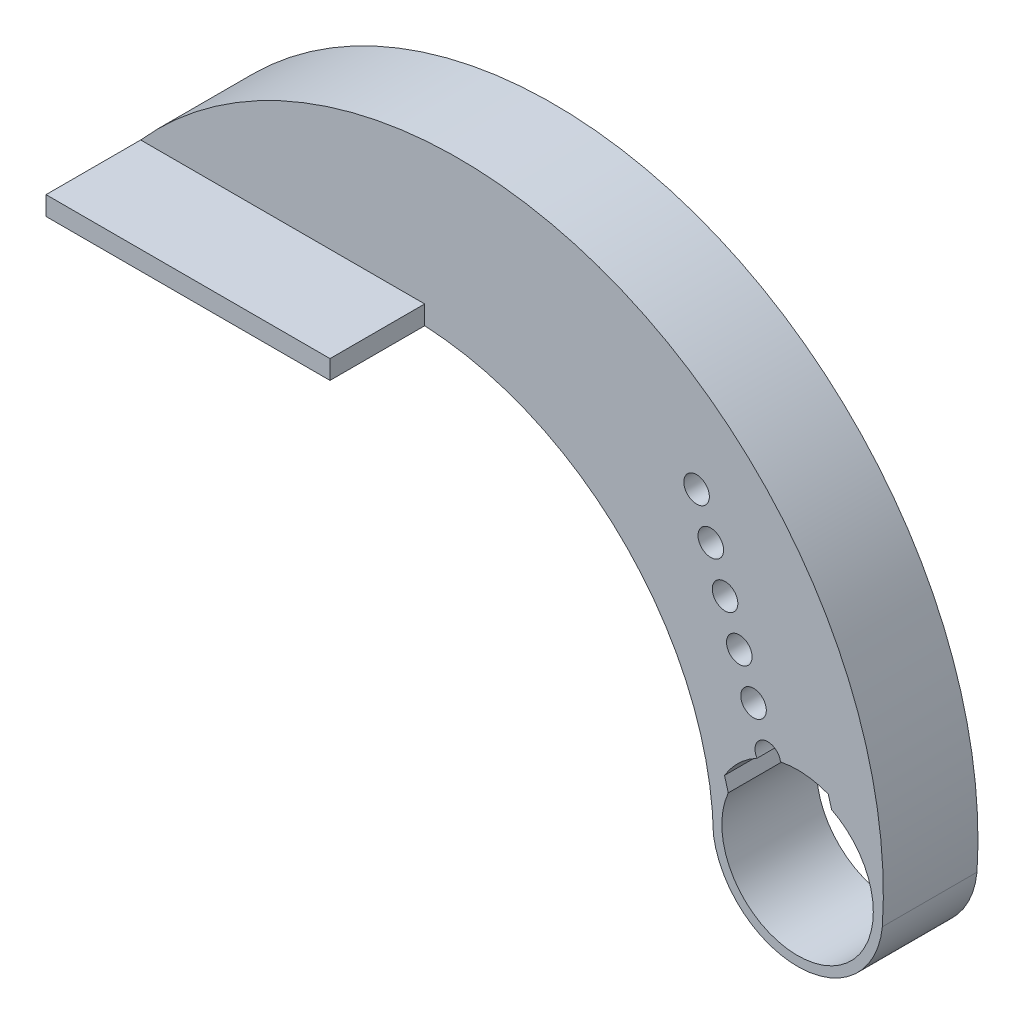
ISO-10303-21;
HEADER;
FILE_DESCRIPTION(('STEP AP214'),'2;1');
FILE_NAME('part.step','',(''),(''),'','','');
FILE_SCHEMA(('AUTOMOTIVE_DESIGN { 1 0 10303 214 1 1 1 1 }'));
ENDSEC;
DATA;
#1=APPLICATION_CONTEXT('core data for automotive mechanical design processes');
#2=APPLICATION_PROTOCOL_DEFINITION('international standard','automotive_design',2000,#1);
#3=PRODUCT_CONTEXT('',#1,'mechanical');
#4=PRODUCT('Part','Part','',(#3));
#5=PRODUCT_RELATED_PRODUCT_CATEGORY('part','',(#4));
#6=PRODUCT_DEFINITION_FORMATION('','',#4);
#7=PRODUCT_DEFINITION_CONTEXT('part definition',#1,'design');
#8=PRODUCT_DEFINITION('design','',#6,#7);
#9=PRODUCT_DEFINITION_SHAPE('','',#8);
#10=(LENGTH_UNIT() NAMED_UNIT(*) SI_UNIT(.MILLI.,.METRE.));
#11=(NAMED_UNIT(*) PLANE_ANGLE_UNIT() SI_UNIT($,.RADIAN.));
#12=(NAMED_UNIT(*) SI_UNIT($,.STERADIAN.) SOLID_ANGLE_UNIT());
#13=UNCERTAINTY_MEASURE_WITH_UNIT(LENGTH_MEASURE(1.E-05),#10,'distance_accuracy_value','');
#14=(GEOMETRIC_REPRESENTATION_CONTEXT(3) GLOBAL_UNCERTAINTY_ASSIGNED_CONTEXT((#13)) GLOBAL_UNIT_ASSIGNED_CONTEXT((#10,
#11,#12)) REPRESENTATION_CONTEXT('',''));
#15=CARTESIAN_POINT('',(0.,0.,0.));
#16=DIRECTION('',(0.,0.,1.));
#17=DIRECTION('',(1.,0.,0.));
#18=AXIS2_PLACEMENT_3D('',#15,#16,#17);
#19=CARTESIAN_POINT('',(2.60138860612411,0.73585763336123,5.));
#20=DIRECTION('',(-0.962243296814246,-0.272190811263074,0.));
#21=DIRECTION('',(0.272190811263074,-0.962243296814246,0.));
#22=AXIS2_PLACEMENT_3D('',#19,#20,#21);
#23=PLANE('',#22);
#24=DIRECTION('',(-0.272190811263074,0.962243296814246,0.));
#25=VECTOR('',#24,1.);
#26=CARTESIAN_POINT('',(2.60138860612411,0.73585763336123,5.));
#27=LINE('',#26,#25);
#28=CARTESIAN_POINT('',(1.79894300223509,3.57264664845397,5.));
#29=VERTEX_POINT('',#28);
#30=CARTESIAN_POINT('',(1.62220922644998,4.19743221810913,5.));
#31=VERTEX_POINT('',#30);
#32=EDGE_CURVE('E385',#29,#31,#27,.T.);
#33=ORIENTED_EDGE('',*,*,#32,.T.);
#34=DIRECTION('',(0.,0.,1.));
#35=VECTOR('',#34,1.);
#36=CARTESIAN_POINT('',(1.62220922644998,4.19743221810913,2.5));
#37=LINE('',#36,#35);
#38=CARTESIAN_POINT('',(1.62220922644998,4.19743221810914,2.5));
#39=VERTEX_POINT('',#38);
#40=EDGE_CURVE('E193',#39,#31,#37,.T.);
#41=ORIENTED_EDGE('',*,*,#40,.F.);
#42=DIRECTION('',(0.272190811263074,-0.962243296814246,0.));
#43=VECTOR('',#42,1.);
#44=CARTESIAN_POINT('',(2.60138860612411,0.73585763336123,2.5));
#45=LINE('',#44,#43);
#46=CARTESIAN_POINT('',(1.56692752095077,4.39286295401909,2.5));
#47=VERTEX_POINT('',#46);
#48=EDGE_CURVE('E305',#47,#39,#45,.T.);
#49=ORIENTED_EDGE('',*,*,#48,.F.);
#50=DIRECTION('',(0.,0.,-1.));
#51=VECTOR('',#50,1.);
#52=CARTESIAN_POINT('',(1.56692752095077,4.39286295401909,5.));
#53=LINE('',#52,#51);
#54=CARTESIAN_POINT('',(1.56692752095077,4.39286295401909,0.));
#55=VERTEX_POINT('',#54);
#56=EDGE_CURVE('E406',#47,#55,#53,.T.);
#57=ORIENTED_EDGE('',*,*,#56,.T.);
#58=DIRECTION('',(-0.272190811263074,0.962243296814246,0.));
#59=VECTOR('',#58,1.);
#60=CARTESIAN_POINT('',(2.60138860612411,0.73585763336123,0.));
#61=LINE('',#60,#59);
#62=CARTESIAN_POINT('',(1.79894300223509,3.57264664845397,0.));
#63=VERTEX_POINT('',#62);
#64=EDGE_CURVE('E384',#63,#55,#61,.T.);
#65=ORIENTED_EDGE('',*,*,#64,.F.);
#66=DIRECTION('',(0.,0.,-1.));
#67=VECTOR('',#66,1.);
#68=CARTESIAN_POINT('',(1.79894300223509,3.57264664845397,5.));
#69=LINE('',#68,#67);
#70=EDGE_CURVE('E179',#29,#63,#69,.T.);
#71=ORIENTED_EDGE('',*,*,#70,.F.);
#72=EDGE_LOOP('',(#33,#41,#49,#57,#65,#71));
#73=FACE_BOUND('',#72,.T.);
#74=ADVANCED_FACE('F176',(#73),#23,.T.);
#75=CARTESIAN_POINT('',(-2.96693358944446,-0.83925974163522,5.));
#76=DIRECTION('',(0.962243296814247,0.272190811263072,0.));
#77=DIRECTION('',(-0.272190811263072,0.962243296814247,0.));
#78=AXIS2_PLACEMENT_3D('',#75,#76,#77);
#79=PLANE('',#78);
#80=DIRECTION('',(-0.272190811263072,0.962243296814247,0.));
#81=VECTOR('',#80,1.);
#82=CARTESIAN_POINT('',(-2.96693358944446,-0.83925974163522,2.5));
#83=LINE('',#82,#81);
#84=CARTESIAN_POINT('',(-3.85907808459386,2.31463092889716,2.5));
#85=VERTEX_POINT('',#84);
#86=CARTESIAN_POINT('',(-3.89291928006643,2.43426561953403,2.5));
#87=VERTEX_POINT('',#86);
#88=EDGE_CURVE('E201',#85,#87,#83,.T.);
#89=ORIENTED_EDGE('',*,*,#88,.F.);
#90=DIRECTION('',(0.,0.,1.));
#91=VECTOR('',#90,1.);
#92=CARTESIAN_POINT('',(-3.85907808459386,2.31463092889716,2.5));
#93=LINE('',#92,#91);
#94=CARTESIAN_POINT('',(-3.85907808459386,2.31463092889716,5.));
#95=VERTEX_POINT('',#94);
#96=EDGE_CURVE('E331',#85,#95,#93,.T.);
#97=ORIENTED_EDGE('',*,*,#96,.T.);
#98=DIRECTION('',(0.272190811263072,-0.962243296814247,0.));
#99=VECTOR('',#98,1.);
#100=CARTESIAN_POINT('',(-2.96693358944446,-0.83925974163522,5.));
#101=LINE('',#100,#99);
#102=CARTESIAN_POINT('',(-3.66051018207658,1.61265780837527,5.));
#103=VERTEX_POINT('',#102);
#104=EDGE_CURVE('E393',#95,#103,#101,.T.);
#105=ORIENTED_EDGE('',*,*,#104,.T.);
#106=DIRECTION('',(0.,0.,-1.));
#107=VECTOR('',#106,1.);
#108=CARTESIAN_POINT('',(-3.66051018207658,1.61265780837527,5.));
#109=LINE('',#108,#107);
#110=CARTESIAN_POINT('',(-3.66051018207658,1.61265780837527,0.));
#111=VERTEX_POINT('',#110);
#112=EDGE_CURVE('E470',#103,#111,#109,.T.);
#113=ORIENTED_EDGE('',*,*,#112,.T.);
#114=DIRECTION('',(0.272190811263072,-0.962243296814247,0.));
#115=VECTOR('',#114,1.);
#116=CARTESIAN_POINT('',(-2.96693358944446,-0.83925974163522,0.));
#117=LINE('',#116,#115);
#118=CARTESIAN_POINT('',(-3.89291928006643,2.43426561953403,0.));
#119=VERTEX_POINT('',#118);
#120=EDGE_CURVE('E414',#119,#111,#117,.T.);
#121=ORIENTED_EDGE('',*,*,#120,.F.);
#122=DIRECTION('',(0.,0.,-1.));
#123=VECTOR('',#122,1.);
#124=CARTESIAN_POINT('',(-3.89291928006643,2.43426561953403,5.));
#125=LINE('',#124,#123);
#126=EDGE_CURVE('E468',#87,#119,#125,.T.);
#127=ORIENTED_EDGE('',*,*,#126,.F.);
#128=EDGE_LOOP('',(#89,#97,#105,#113,#121,#127));
#129=FACE_BOUND('',#128,.T.);
#130=ADVANCED_FACE('F487',(#129),#79,.T.);
#131=CARTESIAN_POINT('',(-2.80822807488953,-0.910653028040652,5.));
#132=DIRECTION('',(0.951235108868791,0.308466801544964,0.));
#133=DIRECTION('',(-0.308466801544964,0.951235108868791,0.));
#134=AXIS2_PLACEMENT_3D('',#131,#132,#133);
#135=PLANE('',#134);
#136=DIRECTION('',(0.,0.,-1.));
#137=VECTOR('',#136,1.);
#138=CARTESIAN_POINT('',(-7.59330385430825,13.8453338632012,5.));
#139=LINE('',#138,#137);
#140=CARTESIAN_POINT('',(-7.59330385430825,13.8453338632012,2.5));
#141=VERTEX_POINT('',#140);
#142=CARTESIAN_POINT('',(-7.59330385430825,13.8453338632012,0.));
#143=VERTEX_POINT('',#142);
#144=EDGE_CURVE('E465',#141,#143,#139,.T.);
#145=ORIENTED_EDGE('',*,*,#144,.F.);
#146=DIRECTION('',(-0.308466801544964,0.951235108868791,0.));
#147=VECTOR('',#146,1.);
#148=CARTESIAN_POINT('',(-2.80822807488953,-0.910653028040652,2.5));
#149=LINE('',#148,#147);
#150=EDGE_CURVE('E342',#87,#141,#149,.T.);
#151=ORIENTED_EDGE('',*,*,#150,.F.);
#152=ORIENTED_EDGE('',*,*,#126,.T.);
#153=DIRECTION('',(0.308466801544964,-0.951235108868791,0.));
#154=VECTOR('',#153,1.);
#155=CARTESIAN_POINT('',(-2.80822807488953,-0.910653028040652,0.));
#156=LINE('',#155,#154);
#157=EDGE_CURVE('E418',#143,#119,#156,.T.);
#158=ORIENTED_EDGE('',*,*,#157,.F.);
#159=EDGE_LOOP('',(#145,#151,#152,#158));
#160=FACE_BOUND('',#159,.T.);
#161=ADVANCED_FACE('F548',(#160),#135,.T.);
#162=CARTESIAN_POINT('',(-5.33551423588044,14.6592048842602,5.));
#163=DIRECTION('',(0.,0.,-1.));
#164=DIRECTION('',(-1.,0.,0.));
#165=AXIS2_PLACEMENT_3D('',#162,#163,#164);
#166=CYLINDRICAL_SURFACE('',#165,2.4);
#167=DIRECTION('',(0.,0.,-1.));
#168=VECTOR('',#167,1.);
#169=CARTESIAN_POINT('',(-3.08369072305505,15.489440312971,5.));
#170=LINE('',#169,#168);
#171=CARTESIAN_POINT('',(-3.08369072305505,15.489440312971,2.5));
#172=VERTEX_POINT('',#171);
#173=CARTESIAN_POINT('',(-3.08369072305505,15.489440312971,0.));
#174=VERTEX_POINT('',#173);
#175=EDGE_CURVE('E462',#172,#174,#170,.T.);
#176=ORIENTED_EDGE('',*,*,#175,.F.);
#177=CARTESIAN_POINT('',(-5.33551423588044,14.6592048842602,2.5));
#178=DIRECTION('',(0.,0.,1.));
#179=DIRECTION('',(1.,0.,0.));
#180=AXIS2_PLACEMENT_3D('',#177,#178,#179);
#181=CIRCLE('',#180,2.4);
#182=EDGE_CURVE('E535',#172,#141,#181,.T.);
#183=ORIENTED_EDGE('',*,*,#182,.T.);
#184=ORIENTED_EDGE('',*,*,#144,.T.);
#185=CARTESIAN_POINT('',(-5.33551423588044,14.6592048842602,0.));
#186=DIRECTION('',(0.,0.,1.));
#187=DIRECTION('',(1.,0.,0.));
#188=AXIS2_PLACEMENT_3D('',#185,#186,#187);
#189=CIRCLE('',#188,2.4);
#190=EDGE_CURVE('E422',#174,#143,#189,.T.);
#191=ORIENTED_EDGE('',*,*,#190,.F.);
#192=EDGE_LOOP('',(#176,#183,#184,#191));
#193=FACE_BOUND('',#192,.T.);
#194=ADVANCED_FACE('F546',(#193),#166,.F.);
#195=CARTESIAN_POINT('',(2.89882105982409,1.21490705384489,5.));
#196=DIRECTION('',(-0.922276917028417,-0.386529802624014,0.));
#197=DIRECTION('',(0.386529802624014,-0.922276917028417,0.));
#198=AXIS2_PLACEMENT_3D('',#195,#196,#197);
#199=PLANE('',#198);
#200=ORIENTED_EDGE('',*,*,#56,.F.);
#201=DIRECTION('',(0.386529802624014,-0.922276917028417,0.));
#202=VECTOR('',#201,1.);
#203=CARTESIAN_POINT('',(2.89882105982409,1.21490705384489,2.5));
#204=LINE('',#203,#202);
#205=EDGE_CURVE('E538',#172,#47,#204,.T.);
#206=ORIENTED_EDGE('',*,*,#205,.F.);
#207=ORIENTED_EDGE('',*,*,#175,.T.);
#208=DIRECTION('',(-0.386529802624014,0.922276917028417,0.));
#209=VECTOR('',#208,1.);
#210=CARTESIAN_POINT('',(2.89882105982409,1.21490705384489,0.));
#211=LINE('',#210,#209);
#212=EDGE_CURVE('E426',#55,#174,#211,.T.);
#213=ORIENTED_EDGE('',*,*,#212,.F.);
#214=EDGE_LOOP('',(#200,#206,#207,#213));
#215=FACE_BOUND('',#214,.T.);
#216=ADVANCED_FACE('F543',(#215),#199,.T.);
#217=CARTESIAN_POINT('',(0.,0.,5.));
#218=DIRECTION('',(0.,0.,-1.));
#219=DIRECTION('',(-1.,0.,0.));
#220=AXIS2_PLACEMENT_3D('',#217,#218,#219);
#221=CYLINDRICAL_SURFACE('',#220,4.5);
#222=CARTESIAN_POINT('',(0.,0.,0.));
#223=DIRECTION('',(0.,0.,1.));
#224=DIRECTION('',(1.,0.,0.));
#225=AXIS2_PLACEMENT_3D('',#222,#223,#224);
#226=CIRCLE('',#225,4.5);
#227=CARTESIAN_POINT('',(-4.4422617449313,-0.718547555503412,0.));
#228=VERTEX_POINT('',#227);
#229=CARTESIAN_POINT('',(4.47802535624061,-0.444172161291281,0.));
#230=VERTEX_POINT('',#229);
#231=EDGE_CURVE('E430',#228,#230,#226,.T.);
#232=ORIENTED_EDGE('',*,*,#231,.T.);
#233=DIRECTION('',(0.,0.,-1.));
#234=VECTOR('',#233,1.);
#235=CARTESIAN_POINT('',(4.47802535624061,-0.444172161291281,5.));
#236=LINE('',#235,#234);
#237=CARTESIAN_POINT('',(4.47802535624061,-0.444172161291281,5.));
#238=VERTEX_POINT('',#237);
#239=EDGE_CURVE('E12',#238,#230,#236,.T.);
#240=ORIENTED_EDGE('',*,*,#239,.F.);
#241=CARTESIAN_POINT('',(0.,0.,5.));
#242=DIRECTION('',(0.,0.,1.));
#243=DIRECTION('',(1.,0.,0.));
#244=AXIS2_PLACEMENT_3D('',#241,#242,#243);
#245=CIRCLE('',#244,4.5);
#246=CARTESIAN_POINT('',(-4.4422617449313,-0.718547555503412,5.));
#247=VERTEX_POINT('',#246);
#248=EDGE_CURVE('E396',#247,#238,#245,.T.);
#249=ORIENTED_EDGE('',*,*,#248,.F.);
#250=DIRECTION('',(0.,0.,-1.));
#251=VECTOR('',#250,1.);
#252=CARTESIAN_POINT('',(-4.4422617449313,-0.718547555503412,5.));
#253=LINE('',#252,#251);
#254=EDGE_CURVE('E446',#247,#228,#253,.T.);
#255=ORIENTED_EDGE('',*,*,#254,.T.);
#256=EDGE_LOOP('',(#232,#240,#249,#255));
#257=FACE_BOUND('',#256,.T.);
#258=ADVANCED_FACE('F584',(#257),#221,.T.);
#259=CARTESIAN_POINT('',(-17.9059611317667,1.0794776193816,5.));
#260=DIRECTION('',(0.,0.,-1.));
#261=DIRECTION('',(-1.,0.,0.));
#262=AXIS2_PLACEMENT_3D('',#259,#260,#261);
#263=CYLINDRICAL_SURFACE('',#262,22.4357830206444);
#264=CARTESIAN_POINT('',(-17.9059611317667,1.0794776193816,0.));
#265=DIRECTION('',(0.,0.,1.));
#266=DIRECTION('',(1.,0.,0.));
#267=AXIS2_PLACEMENT_3D('',#264,#265,#266);
#268=CIRCLE('',#267,22.4357830206444);
#269=CARTESIAN_POINT('',(-34.6967923191629,15.9600806913609,0.));
#270=VERTEX_POINT('',#269);
#271=EDGE_CURVE('E434',#270,#230,#268,.F.);
#272=ORIENTED_EDGE('',*,*,#271,.F.);
#273=DIRECTION('',(0.,0.,-1.));
#274=VECTOR('',#273,1.);
#275=CARTESIAN_POINT('',(-34.6967923191629,15.9600806913609,5.));
#276=LINE('',#275,#274);
#277=CARTESIAN_POINT('',(-34.6967923191629,15.9600806913609,5.));
#278=VERTEX_POINT('',#277);
#279=EDGE_CURVE('E185',#278,#270,#276,.T.);
#280=ORIENTED_EDGE('',*,*,#279,.F.);
#281=CARTESIAN_POINT('',(-17.9059611317667,1.0794776193816,5.));
#282=DIRECTION('',(0.,0.,1.));
#283=DIRECTION('',(1.,0.,0.));
#284=AXIS2_PLACEMENT_3D('',#281,#282,#283);
#285=CIRCLE('',#284,22.4357830206444);
#286=EDGE_CURVE('E399',#278,#238,#285,.F.);
#287=ORIENTED_EDGE('',*,*,#286,.T.);
#288=ORIENTED_EDGE('',*,*,#239,.T.);
#289=EDGE_LOOP('',(#272,#280,#287,#288));
#290=FACE_BOUND('',#289,.T.);
#291=ADVANCED_FACE('F708',(#290),#263,.T.);
#292=CARTESIAN_POINT('',(-34.6967923191629,0.,5.));
#293=DIRECTION('',(1.,0.,0.));
#294=DIRECTION('',(0.,0.,-1.));
#295=AXIS2_PLACEMENT_3D('',#292,#293,#294);
#296=PLANE('',#295);
#297=DIRECTION('',(0.,-1.,0.));
#298=VECTOR('',#297,1.);
#299=CARTESIAN_POINT('',(-34.6967923191629,0.,0.));
#300=LINE('',#299,#298);
#301=CARTESIAN_POINT('',(-34.6967923191629,14.9600806913609,0.));
#302=VERTEX_POINT('',#301);
#303=EDGE_CURVE('E438',#270,#302,#300,.T.);
#304=ORIENTED_EDGE('',*,*,#303,.T.);
#305=DIRECTION('',(0.,0.,-1.));
#306=VECTOR('',#305,1.);
#307=CARTESIAN_POINT('',(-34.6967923191629,14.9600806913609,5.));
#308=LINE('',#307,#306);
#309=CARTESIAN_POINT('',(-34.6967923191629,14.9600806913609,10.));
#310=VERTEX_POINT('',#309);
#311=EDGE_CURVE('E454',#310,#302,#308,.T.);
#312=ORIENTED_EDGE('',*,*,#311,.F.);
#313=DIRECTION('',(0.,-1.,0.));
#314=VECTOR('',#313,1.);
#315=CARTESIAN_POINT('',(-34.6967923191629,0.,10.));
#316=LINE('',#315,#314);
#317=CARTESIAN_POINT('',(-34.6967923191629,15.9600806913609,10.));
#318=VERTEX_POINT('',#317);
#319=EDGE_CURVE('E357',#318,#310,#316,.T.);
#320=ORIENTED_EDGE('',*,*,#319,.F.);
#321=DIRECTION('',(0.,0.,-1.));
#322=VECTOR('',#321,1.);
#323=CARTESIAN_POINT('',(-34.6967923191629,15.9600806913609,10.));
#324=LINE('',#323,#322);
#325=EDGE_CURVE('E368',#318,#278,#324,.T.);
#326=ORIENTED_EDGE('',*,*,#325,.T.);
#327=ORIENTED_EDGE('',*,*,#279,.T.);
#328=EDGE_LOOP('',(#304,#312,#320,#326,#327));
#329=FACE_BOUND('',#328,.T.);
#330=ADVANCED_FACE('F704',(#329),#296,.F.);
#331=CARTESIAN_POINT('',(0.,14.9600806913609,5.));
#332=DIRECTION('',(0.,1.,0.));
#333=DIRECTION('',(0.,0.,1.));
#334=AXIS2_PLACEMENT_3D('',#331,#332,#333);
#335=PLANE('',#334);
#336=DIRECTION('',(1.,0.,0.));
#337=VECTOR('',#336,1.);
#338=CARTESIAN_POINT('',(0.,14.9600806913609,0.));
#339=LINE('',#338,#337);
#340=CARTESIAN_POINT('',(-19.6967923191628,14.9600806913609,0.));
#341=VERTEX_POINT('',#340);
#342=EDGE_CURVE('E441',#302,#341,#339,.T.);
#343=ORIENTED_EDGE('',*,*,#342,.T.);
#344=DIRECTION('',(0.,0.,-1.));
#345=VECTOR('',#344,1.);
#346=CARTESIAN_POINT('',(-19.6967923191628,14.9600806913609,5.));
#347=LINE('',#346,#345);
#348=CARTESIAN_POINT('',(-19.6967923191628,14.9600806913609,5.));
#349=VERTEX_POINT('',#348);
#350=EDGE_CURVE('E450',#349,#341,#347,.T.);
#351=ORIENTED_EDGE('',*,*,#350,.F.);
#352=DIRECTION('',(0.,0.,-1.));
#353=VECTOR('',#352,1.);
#354=CARTESIAN_POINT('',(-19.6967923191628,14.9600806913609,10.));
#355=LINE('',#354,#353);
#356=CARTESIAN_POINT('',(-19.6967923191628,14.9600806913609,10.));
#357=VERTEX_POINT('',#356);
#358=EDGE_CURVE('E364',#357,#349,#355,.T.);
#359=ORIENTED_EDGE('',*,*,#358,.F.);
#360=DIRECTION('',(1.,0.,0.));
#361=VECTOR('',#360,1.);
#362=CARTESIAN_POINT('',(0.,14.9600806913609,10.));
#363=LINE('',#362,#361);
#364=EDGE_CURVE('E361',#310,#357,#363,.T.);
#365=ORIENTED_EDGE('',*,*,#364,.F.);
#366=ORIENTED_EDGE('',*,*,#311,.T.);
#367=EDGE_LOOP('',(#343,#351,#359,#365,#366));
#368=FACE_BOUND('',#367,.T.);
#369=ADVANCED_FACE('F701',(#368),#335,.F.);
#370=CARTESIAN_POINT('',(0.,0.,5.));
#371=DIRECTION('',(0.,0.,-1.));
#372=DIRECTION('',(-1.,0.,0.));
#373=AXIS2_PLACEMENT_3D('',#370,#371,#372);
#374=CYLINDRICAL_SURFACE('',#373,4.);
#375=CARTESIAN_POINT('',(0.,0.,0.));
#376=DIRECTION('',(0.,0.,1.));
#377=DIRECTION('',(1.,0.,0.));
#378=AXIS2_PLACEMENT_3D('',#375,#376,#377);
#379=CIRCLE('',#378,4.);
#380=EDGE_CURVE('E410',#111,#63,#379,.T.);
#381=ORIENTED_EDGE('',*,*,#380,.F.);
#382=ORIENTED_EDGE('',*,*,#112,.F.);
#383=CARTESIAN_POINT('',(0.,0.,5.));
#384=DIRECTION('',(0.,0.,1.));
#385=DIRECTION('',(1.,0.,0.));
#386=AXIS2_PLACEMENT_3D('',#383,#384,#385);
#387=CIRCLE('',#386,4.);
#388=EDGE_CURVE('E388',#103,#29,#387,.T.);
#389=ORIENTED_EDGE('',*,*,#388,.T.);
#390=ORIENTED_EDGE('',*,*,#70,.T.);
#391=EDGE_LOOP('',(#381,#382,#389,#390));
#392=FACE_BOUND('',#391,.T.);
#393=ADVANCED_FACE('F478',(#392),#374,.F.);
#394=CARTESIAN_POINT('',(-20.4642225082948,-1.04685733305859,5.));
#395=DIRECTION('',(0.,0.,-1.));
#396=DIRECTION('',(-1.,0.,0.));
#397=AXIS2_PLACEMENT_3D('',#394,#395,#396);
#398=CYLINDRICAL_SURFACE('',#397,16.025324146887);
#399=CARTESIAN_POINT('',(-20.4642225082948,-1.04685733305859,0.));
#400=DIRECTION('',(0.,0.,1.));
#401=DIRECTION('',(1.,0.,0.));
#402=AXIS2_PLACEMENT_3D('',#399,#400,#401);
#403=CIRCLE('',#402,16.025324146887);
#404=EDGE_CURVE('E389',#341,#228,#403,.F.);
#405=ORIENTED_EDGE('',*,*,#404,.T.);
#406=ORIENTED_EDGE('',*,*,#254,.F.);
#407=CARTESIAN_POINT('',(-20.4642225082948,-1.04685733305859,5.));
#408=DIRECTION('',(0.,0.,1.));
#409=DIRECTION('',(1.,0.,0.));
#410=AXIS2_PLACEMENT_3D('',#407,#408,#409);
#411=CIRCLE('',#410,16.025324146887);
#412=EDGE_CURVE('E403',#349,#247,#411,.F.);
#413=ORIENTED_EDGE('',*,*,#412,.F.);
#414=ORIENTED_EDGE('',*,*,#350,.T.);
#415=EDGE_LOOP('',(#405,#406,#413,#414));
#416=FACE_BOUND('',#415,.T.);
#417=ADVANCED_FACE('F498',(#416),#398,.F.);
#418=CARTESIAN_POINT('',(0.,0.,5.));
#419=DIRECTION('',(0.,0.,1.));
#420=DIRECTION('',(1.,0.,0.));
#421=AXIS2_PLACEMENT_3D('',#418,#419,#420);
#422=PLANE('',#421);
#423=CARTESIAN_POINT('',(0.,0.,5.));
#424=DIRECTION('',(0.,0.,1.));
#425=DIRECTION('',(1.,0.,0.));
#426=AXIS2_PLACEMENT_3D('',#423,#424,#425);
#427=CIRCLE('',#426,4.5);
#428=CARTESIAN_POINT('',(-0.903758530875822,4.40831266108351,5.));
#429=VERTEX_POINT('',#428);
#430=EDGE_CURVE('E313',#31,#429,#427,.T.);
#431=ORIENTED_EDGE('',*,*,#430,.F.);
#432=ORIENTED_EDGE('',*,*,#32,.F.);
#433=ORIENTED_EDGE('',*,*,#388,.F.);
#434=ORIENTED_EDGE('',*,*,#104,.F.);
#435=CARTESIAN_POINT('',(0.,0.,5.));
#436=DIRECTION('',(0.,0.,1.));
#437=DIRECTION('',(1.,0.,0.));
#438=AXIS2_PLACEMENT_3D('',#435,#436,#437);
#439=CIRCLE('',#438,4.5);
#440=CARTESIAN_POINT('',(-2.14128955767,3.95788820334954,5.));
#441=VERTEX_POINT('',#440);
#442=EDGE_CURVE('E338',#441,#95,#439,.T.);
#443=ORIENTED_EDGE('',*,*,#442,.F.);
#444=CARTESIAN_POINT('',(-1.57329265929809,4.32258605561518,5.));
#445=DIRECTION('',(0.,0.,1.));
#446=DIRECTION('',(1.,0.,0.));
#447=AXIS2_PLACEMENT_3D('',#444,#445,#446);
#448=CIRCLE('',#447,0.675000000005395);
#449=EDGE_CURVE('E334',#429,#441,#448,.T.);
#450=ORIENTED_EDGE('',*,*,#449,.F.);
#451=EDGE_LOOP('',(#431,#432,#433,#434,#443,#450));
#452=FACE_BOUND('',#451,.T.);
#453=DIRECTION('',(0.,1.,0.));
#454=VECTOR('',#453,1.);
#455=CARTESIAN_POINT('',(-19.6967923191629,0.,5.));
#456=LINE('',#455,#454);
#457=CARTESIAN_POINT('',(-19.6967923191628,15.9600806913609,5.));
#458=VERTEX_POINT('',#457);
#459=EDGE_CURVE('E380',#349,#458,#456,.T.);
#460=ORIENTED_EDGE('',*,*,#459,.F.);
#461=ORIENTED_EDGE('',*,*,#412,.T.);
#462=ORIENTED_EDGE('',*,*,#248,.T.);
#463=ORIENTED_EDGE('',*,*,#286,.F.);
#464=DIRECTION('',(-1.,0.,0.));
#465=VECTOR('',#464,1.);
#466=CARTESIAN_POINT('',(0.,15.9600806913609,5.));
#467=LINE('',#466,#465);
#468=EDGE_CURVE('E376',#458,#278,#467,.T.);
#469=ORIENTED_EDGE('',*,*,#468,.F.);
#470=EDGE_LOOP('',(#460,#461,#462,#463,#469));
#471=FACE_BOUND('',#470,.T.);
#472=CARTESIAN_POINT('',(-5.33551423588044,14.6592048842602,5.));
#473=DIRECTION('',(0.,0.,1.));
#474=DIRECTION('',(1.,0.,0.));
#475=AXIS2_PLACEMENT_3D('',#472,#473,#474);
#476=CIRCLE('',#475,0.675000000005409);
#477=CARTESIAN_POINT('',(-4.66051423587503,14.6592048842602,5.));
#478=VERTEX_POINT('',#477);
#479=EDGE_CURVE('E505',#478,#478,#476,.T.);
#480=ORIENTED_EDGE('',*,*,#479,.F.);
#481=EDGE_LOOP('',(#480));
#482=FACE_BOUND('',#481,.T.);
#483=CARTESIAN_POINT('',(-2.32573697461455,6.38990982134418,5.));
#484=DIRECTION('',(0.,0.,1.));
#485=DIRECTION('',(1.,0.,0.));
#486=AXIS2_PLACEMENT_3D('',#483,#484,#485);
#487=CIRCLE('',#486,0.675000000005402);
#488=CARTESIAN_POINT('',(-1.65073697460915,6.38990982134418,5.));
#489=VERTEX_POINT('',#488);
#490=EDGE_CURVE('E509',#489,#489,#487,.T.);
#491=ORIENTED_EDGE('',*,*,#490,.F.);
#492=EDGE_LOOP('',(#491));
#493=FACE_BOUND('',#492,.T.);
#494=CARTESIAN_POINT('',(-3.07818128993102,8.45723358707318,5.));
#495=DIRECTION('',(0.,0.,1.));
#496=DIRECTION('',(1.,0.,0.));
#497=AXIS2_PLACEMENT_3D('',#494,#495,#496);
#498=CIRCLE('',#497,0.67500000000541);
#499=CARTESIAN_POINT('',(-2.40318128992561,8.45723358707318,5.));
#500=VERTEX_POINT('',#499);
#501=EDGE_CURVE('E513',#500,#500,#498,.T.);
#502=ORIENTED_EDGE('',*,*,#501,.F.);
#503=EDGE_LOOP('',(#502));
#504=FACE_BOUND('',#503,.T.);
#505=CARTESIAN_POINT('',(-3.83062560524749,10.5245573528022,5.));
#506=DIRECTION('',(0.,0.,1.));
#507=DIRECTION('',(1.,0.,0.));
#508=AXIS2_PLACEMENT_3D('',#505,#506,#507);
#509=CIRCLE('',#508,0.675000000005391);
#510=CARTESIAN_POINT('',(-3.1556256052421,10.5245573528022,5.));
#511=VERTEX_POINT('',#510);
#512=EDGE_CURVE('E517',#511,#511,#509,.T.);
#513=ORIENTED_EDGE('',*,*,#512,.F.);
#514=EDGE_LOOP('',(#513));
#515=FACE_BOUND('',#514,.T.);
#516=CARTESIAN_POINT('',(-4.58306992056396,12.5918811185312,5.));
#517=DIRECTION('',(0.,0.,1.));
#518=DIRECTION('',(1.,0.,0.));
#519=AXIS2_PLACEMENT_3D('',#516,#517,#518);
#520=CIRCLE('',#519,0.675000000005416);
#521=CARTESIAN_POINT('',(-3.90806992055854,12.5918811185312,5.));
#522=VERTEX_POINT('',#521);
#523=EDGE_CURVE('E520',#522,#522,#520,.T.);
#524=ORIENTED_EDGE('',*,*,#523,.F.);
#525=EDGE_LOOP('',(#524));
#526=FACE_BOUND('',#525,.T.);
#527=ADVANCED_FACE('F495',(#452,#471,#482,#493,#504,#515,#526),#422,.T.);
#528=CARTESIAN_POINT('',(0.,0.,0.));
#529=DIRECTION('',(0.,0.,1.));
#530=DIRECTION('',(1.,0.,0.));
#531=AXIS2_PLACEMENT_3D('',#528,#529,#530);
#532=PLANE('',#531);
#533=ORIENTED_EDGE('',*,*,#64,.T.);
#534=ORIENTED_EDGE('',*,*,#212,.T.);
#535=ORIENTED_EDGE('',*,*,#190,.T.);
#536=ORIENTED_EDGE('',*,*,#157,.T.);
#537=ORIENTED_EDGE('',*,*,#120,.T.);
#538=ORIENTED_EDGE('',*,*,#380,.T.);
#539=EDGE_LOOP('',(#533,#534,#535,#536,#537,#538));
#540=FACE_BOUND('',#539,.T.);
#541=ORIENTED_EDGE('',*,*,#404,.F.);
#542=ORIENTED_EDGE('',*,*,#342,.F.);
#543=ORIENTED_EDGE('',*,*,#303,.F.);
#544=ORIENTED_EDGE('',*,*,#271,.T.);
#545=ORIENTED_EDGE('',*,*,#231,.F.);
#546=EDGE_LOOP('',(#541,#542,#543,#544,#545));
#547=FACE_BOUND('',#546,.T.);
#548=ADVANCED_FACE('F484',(#540,#547),#532,.F.);
#549=CARTESIAN_POINT('',(-19.6967923191629,0.,10.));
#550=DIRECTION('',(1.,0.,0.));
#551=DIRECTION('',(0.,1.,0.));
#552=AXIS2_PLACEMENT_3D('',#549,#550,#551);
#553=PLANE('',#552);
#554=ORIENTED_EDGE('',*,*,#358,.T.);
#555=ORIENTED_EDGE('',*,*,#459,.T.);
#556=DIRECTION('',(0.,0.,-1.));
#557=VECTOR('',#556,1.);
#558=CARTESIAN_POINT('',(-19.6967923191628,15.9600806913609,10.));
#559=LINE('',#558,#557);
#560=CARTESIAN_POINT('',(-19.6967923191628,15.9600806913609,10.));
#561=VERTEX_POINT('',#560);
#562=EDGE_CURVE('E372',#561,#458,#559,.T.);
#563=ORIENTED_EDGE('',*,*,#562,.F.);
#564=DIRECTION('',(0.,-1.,0.));
#565=VECTOR('',#564,1.);
#566=CARTESIAN_POINT('',(-19.6967923191629,0.,10.));
#567=LINE('',#566,#565);
#568=EDGE_CURVE('E349',#561,#357,#567,.T.);
#569=ORIENTED_EDGE('',*,*,#568,.T.);
#570=EDGE_LOOP('',(#554,#555,#563,#569));
#571=FACE_BOUND('',#570,.T.);
#572=ADVANCED_FACE('F693',(#571),#553,.T.);
#573=CARTESIAN_POINT('',(0.,15.9600806913609,10.));
#574=DIRECTION('',(0.,1.,0.));
#575=DIRECTION('',(0.,0.,1.));
#576=AXIS2_PLACEMENT_3D('',#573,#574,#575);
#577=PLANE('',#576);
#578=ORIENTED_EDGE('',*,*,#562,.T.);
#579=ORIENTED_EDGE('',*,*,#468,.T.);
#580=ORIENTED_EDGE('',*,*,#325,.F.);
#581=DIRECTION('',(1.,0.,0.));
#582=VECTOR('',#581,1.);
#583=CARTESIAN_POINT('',(0.,15.9600806913609,10.));
#584=LINE('',#583,#582);
#585=EDGE_CURVE('E353',#318,#561,#584,.T.);
#586=ORIENTED_EDGE('',*,*,#585,.T.);
#587=EDGE_LOOP('',(#578,#579,#580,#586));
#588=FACE_BOUND('',#587,.T.);
#589=ADVANCED_FACE('F689',(#588),#577,.T.);
#590=CARTESIAN_POINT('',(0.,0.,10.));
#591=DIRECTION('',(0.,0.,1.));
#592=DIRECTION('',(1.,0.,0.));
#593=AXIS2_PLACEMENT_3D('',#590,#591,#592);
#594=PLANE('',#593);
#595=ORIENTED_EDGE('',*,*,#568,.F.);
#596=ORIENTED_EDGE('',*,*,#585,.F.);
#597=ORIENTED_EDGE('',*,*,#319,.T.);
#598=ORIENTED_EDGE('',*,*,#364,.T.);
#599=EDGE_LOOP('',(#595,#596,#597,#598));
#600=FACE_BOUND('',#599,.T.);
#601=ADVANCED_FACE('F604',(#600),#594,.T.);
#602=CARTESIAN_POINT('',(0.,0.,2.5));
#603=DIRECTION('',(0.,0.,1.));
#604=DIRECTION('',(1.,0.,0.));
#605=AXIS2_PLACEMENT_3D('',#602,#603,#604);
#606=CYLINDRICAL_SURFACE('',#605,4.5);
#607=ORIENTED_EDGE('',*,*,#430,.T.);
#608=DIRECTION('',(0.,0.,1.));
#609=VECTOR('',#608,1.);
#610=CARTESIAN_POINT('',(-0.903758530875822,4.40831266108351,2.5));
#611=LINE('',#610,#609);
#612=CARTESIAN_POINT('',(-0.903758530875822,4.40831266108351,2.5));
#613=VERTEX_POINT('',#612);
#614=EDGE_CURVE('E310',#613,#429,#611,.T.);
#615=ORIENTED_EDGE('',*,*,#614,.F.);
#616=CARTESIAN_POINT('',(0.,0.,2.5));
#617=DIRECTION('',(0.,0.,1.));
#618=DIRECTION('',(1.,0.,0.));
#619=AXIS2_PLACEMENT_3D('',#616,#617,#618);
#620=CIRCLE('',#619,4.5);
#621=EDGE_CURVE('E297',#39,#613,#620,.T.);
#622=ORIENTED_EDGE('',*,*,#621,.F.);
#623=ORIENTED_EDGE('',*,*,#40,.T.);
#624=EDGE_LOOP('',(#607,#615,#622,#623));
#625=FACE_BOUND('',#624,.T.);
#626=ADVANCED_FACE('F311',(#625),#606,.F.);
#627=CARTESIAN_POINT('',(-1.57329265929809,4.32258605561518,2.5));
#628=DIRECTION('',(0.,0.,1.));
#629=DIRECTION('',(1.,0.,0.));
#630=AXIS2_PLACEMENT_3D('',#627,#628,#629);
#631=CYLINDRICAL_SURFACE('',#630,0.675000000005395);
#632=ORIENTED_EDGE('',*,*,#449,.T.);
#633=DIRECTION('',(0.,0.,1.));
#634=VECTOR('',#633,1.);
#635=CARTESIAN_POINT('',(-2.14128955767,3.95788820334954,2.5));
#636=LINE('',#635,#634);
#637=CARTESIAN_POINT('',(-2.14128955767,3.95788820334954,2.5));
#638=VERTEX_POINT('',#637);
#639=EDGE_CURVE('E317',#638,#441,#636,.T.);
#640=ORIENTED_EDGE('',*,*,#639,.F.);
#641=CARTESIAN_POINT('',(-1.57329265929809,4.32258605561518,2.5));
#642=DIRECTION('',(0.,0.,1.));
#643=DIRECTION('',(1.,0.,0.));
#644=AXIS2_PLACEMENT_3D('',#641,#642,#643);
#645=CIRCLE('',#644,0.675000000005395);
#646=EDGE_CURVE('E302',#613,#638,#645,.T.);
#647=ORIENTED_EDGE('',*,*,#646,.F.);
#648=ORIENTED_EDGE('',*,*,#614,.T.);
#649=EDGE_LOOP('',(#632,#640,#647,#648));
#650=FACE_BOUND('',#649,.T.);
#651=ADVANCED_FACE('F319',(#650),#631,.F.);
#652=CARTESIAN_POINT('',(0.,0.,2.5));
#653=DIRECTION('',(0.,0.,1.));
#654=DIRECTION('',(1.,0.,0.));
#655=AXIS2_PLACEMENT_3D('',#652,#653,#654);
#656=CYLINDRICAL_SURFACE('',#655,4.5);
#657=ORIENTED_EDGE('',*,*,#442,.T.);
#658=ORIENTED_EDGE('',*,*,#96,.F.);
#659=CARTESIAN_POINT('',(0.,0.,2.5));
#660=DIRECTION('',(0.,0.,1.));
#661=DIRECTION('',(1.,0.,0.));
#662=AXIS2_PLACEMENT_3D('',#659,#660,#661);
#663=CIRCLE('',#662,4.5);
#664=EDGE_CURVE('E323',#638,#85,#663,.T.);
#665=ORIENTED_EDGE('',*,*,#664,.F.);
#666=ORIENTED_EDGE('',*,*,#639,.T.);
#667=EDGE_LOOP('',(#657,#658,#665,#666));
#668=FACE_BOUND('',#667,.T.);
#669=ADVANCED_FACE('F492',(#668),#656,.F.);
#670=CARTESIAN_POINT('',(-5.33551423588044,14.6592048842602,2.5));
#671=DIRECTION('',(0.,0.,1.));
#672=DIRECTION('',(1.,0.,0.));
#673=AXIS2_PLACEMENT_3D('',#670,#671,#672);
#674=PLANE('',#673);
#675=CARTESIAN_POINT('',(-5.33551423588044,14.6592048842602,2.5));
#676=DIRECTION('',(0.,0.,1.));
#677=DIRECTION('',(1.,0.,0.));
#678=AXIS2_PLACEMENT_3D('',#675,#676,#677);
#679=CIRCLE('',#678,0.675000000005409);
#680=CARTESIAN_POINT('',(-4.66051423587503,14.6592048842602,2.5));
#681=VERTEX_POINT('',#680);
#682=EDGE_CURVE('E814',#681,#681,#679,.T.);
#683=ORIENTED_EDGE('',*,*,#682,.T.);
#684=EDGE_LOOP('',(#683));
#685=FACE_BOUND('',#684,.T.);
#686=CARTESIAN_POINT('',(-2.32573697461455,6.38990982134418,2.5));
#687=DIRECTION('',(0.,0.,1.));
#688=DIRECTION('',(1.,0.,0.));
#689=AXIS2_PLACEMENT_3D('',#686,#687,#688);
#690=CIRCLE('',#689,0.675000000005402);
#691=CARTESIAN_POINT('',(-1.65073697460915,6.38990982134418,2.5));
#692=VERTEX_POINT('',#691);
#693=EDGE_CURVE('E820',#692,#692,#690,.T.);
#694=ORIENTED_EDGE('',*,*,#693,.T.);
#695=EDGE_LOOP('',(#694));
#696=FACE_BOUND('',#695,.T.);
#697=CARTESIAN_POINT('',(-3.07818128993102,8.45723358707318,2.5));
#698=DIRECTION('',(0.,0.,1.));
#699=DIRECTION('',(1.,0.,0.));
#700=AXIS2_PLACEMENT_3D('',#697,#698,#699);
#701=CIRCLE('',#700,0.67500000000541);
#702=CARTESIAN_POINT('',(-2.40318128992561,8.45723358707318,2.5));
#703=VERTEX_POINT('',#702);
#704=EDGE_CURVE('E826',#703,#703,#701,.T.);
#705=ORIENTED_EDGE('',*,*,#704,.T.);
#706=EDGE_LOOP('',(#705));
#707=FACE_BOUND('',#706,.T.);
#708=CARTESIAN_POINT('',(-3.83062560524749,10.5245573528022,2.5));
#709=DIRECTION('',(0.,0.,1.));
#710=DIRECTION('',(1.,0.,0.));
#711=AXIS2_PLACEMENT_3D('',#708,#709,#710);
#712=CIRCLE('',#711,0.675000000005391);
#713=CARTESIAN_POINT('',(-3.1556256052421,10.5245573528022,2.5));
#714=VERTEX_POINT('',#713);
#715=EDGE_CURVE('E523',#714,#714,#712,.T.);
#716=ORIENTED_EDGE('',*,*,#715,.T.);
#717=EDGE_LOOP('',(#716));
#718=FACE_BOUND('',#717,.T.);
#719=CARTESIAN_POINT('',(-4.58306992056396,12.5918811185312,2.5));
#720=DIRECTION('',(0.,0.,1.));
#721=DIRECTION('',(1.,0.,0.));
#722=AXIS2_PLACEMENT_3D('',#719,#720,#721);
#723=CIRCLE('',#722,0.675000000005416);
#724=CARTESIAN_POINT('',(-3.90806992055854,12.5918811185312,2.5));
#725=VERTEX_POINT('',#724);
#726=EDGE_CURVE('E335',#725,#725,#723,.T.);
#727=ORIENTED_EDGE('',*,*,#726,.T.);
#728=EDGE_LOOP('',(#727));
#729=FACE_BOUND('',#728,.T.);
#730=ORIENTED_EDGE('',*,*,#150,.T.);
#731=ORIENTED_EDGE('',*,*,#182,.F.);
#732=ORIENTED_EDGE('',*,*,#205,.T.);
#733=ORIENTED_EDGE('',*,*,#48,.T.);
#734=ORIENTED_EDGE('',*,*,#621,.T.);
#735=ORIENTED_EDGE('',*,*,#646,.T.);
#736=ORIENTED_EDGE('',*,*,#664,.T.);
#737=ORIENTED_EDGE('',*,*,#88,.T.);
#738=EDGE_LOOP('',(#730,#731,#732,#733,#734,#735,#736,#737));
#739=FACE_BOUND('',#738,.T.);
#740=ADVANCED_FACE('F300',(#685,#696,#707,#718,#729,#739),#674,.F.);
#741=CARTESIAN_POINT('',(-4.58306992056396,12.5918811185312,2.5));
#742=DIRECTION('',(0.,0.,1.));
#743=DIRECTION('',(1.,0.,0.));
#744=AXIS2_PLACEMENT_3D('',#741,#742,#743);
#745=CYLINDRICAL_SURFACE('',#744,0.675000000005416);
#746=ORIENTED_EDGE('',*,*,#726,.F.);
#747=EDGE_LOOP('',(#746));
#748=FACE_BOUND('',#747,.T.);
#749=ORIENTED_EDGE('',*,*,#523,.T.);
#750=EDGE_LOOP('',(#749));
#751=FACE_BOUND('',#750,.T.);
#752=ADVANCED_FACE('F631',(#748,#751),#745,.F.);
#753=CARTESIAN_POINT('',(-3.83062560524749,10.5245573528022,2.5));
#754=DIRECTION('',(0.,0.,1.));
#755=DIRECTION('',(1.,0.,0.));
#756=AXIS2_PLACEMENT_3D('',#753,#754,#755);
#757=CYLINDRICAL_SURFACE('',#756,0.675000000005391);
#758=ORIENTED_EDGE('',*,*,#715,.F.);
#759=EDGE_LOOP('',(#758));
#760=FACE_BOUND('',#759,.T.);
#761=ORIENTED_EDGE('',*,*,#512,.T.);
#762=EDGE_LOOP('',(#761));
#763=FACE_BOUND('',#762,.T.);
#764=ADVANCED_FACE('F641',(#760,#763),#757,.F.);
#765=CARTESIAN_POINT('',(-3.07818128993102,8.45723358707318,2.5));
#766=DIRECTION('',(0.,0.,1.));
#767=DIRECTION('',(1.,0.,0.));
#768=AXIS2_PLACEMENT_3D('',#765,#766,#767);
#769=CYLINDRICAL_SURFACE('',#768,0.67500000000541);
#770=ORIENTED_EDGE('',*,*,#704,.F.);
#771=EDGE_LOOP('',(#770));
#772=FACE_BOUND('',#771,.T.);
#773=ORIENTED_EDGE('',*,*,#501,.T.);
#774=EDGE_LOOP('',(#773));
#775=FACE_BOUND('',#774,.T.);
#776=ADVANCED_FACE('F651',(#772,#775),#769,.F.);
#777=CARTESIAN_POINT('',(-2.32573697461455,6.38990982134418,2.5));
#778=DIRECTION('',(0.,0.,1.));
#779=DIRECTION('',(1.,0.,0.));
#780=AXIS2_PLACEMENT_3D('',#777,#778,#779);
#781=CYLINDRICAL_SURFACE('',#780,0.675000000005402);
#782=ORIENTED_EDGE('',*,*,#693,.F.);
#783=EDGE_LOOP('',(#782));
#784=FACE_BOUND('',#783,.T.);
#785=ORIENTED_EDGE('',*,*,#490,.T.);
#786=EDGE_LOOP('',(#785));
#787=FACE_BOUND('',#786,.T.);
#788=ADVANCED_FACE('F661',(#784,#787),#781,.F.);
#789=CARTESIAN_POINT('',(-5.33551423588044,14.6592048842602,2.5));
#790=DIRECTION('',(0.,0.,1.));
#791=DIRECTION('',(1.,0.,0.));
#792=AXIS2_PLACEMENT_3D('',#789,#790,#791);
#793=CYLINDRICAL_SURFACE('',#792,0.675000000005409);
#794=ORIENTED_EDGE('',*,*,#682,.F.);
#795=EDGE_LOOP('',(#794));
#796=FACE_BOUND('',#795,.T.);
#797=ORIENTED_EDGE('',*,*,#479,.T.);
#798=EDGE_LOOP('',(#797));
#799=FACE_BOUND('',#798,.T.);
#800=ADVANCED_FACE('F671',(#796,#799),#793,.F.);
#801=CLOSED_SHELL('',(#74,#130,#161,#194,#216,#258,#291,#330,#369,#393,#417,#527,#548,#572,#589,
#601,#626,#651,#669,#740,#752,#764,#776,#788,#800));
#802=MANIFOLD_SOLID_BREP('B2',#801);
#803=ADVANCED_BREP_SHAPE_REPRESENTATION('',(#18,#802),#14);
#804=SHAPE_DEFINITION_REPRESENTATION(#9,#803);
ENDSEC;
END-ISO-10303-21;
